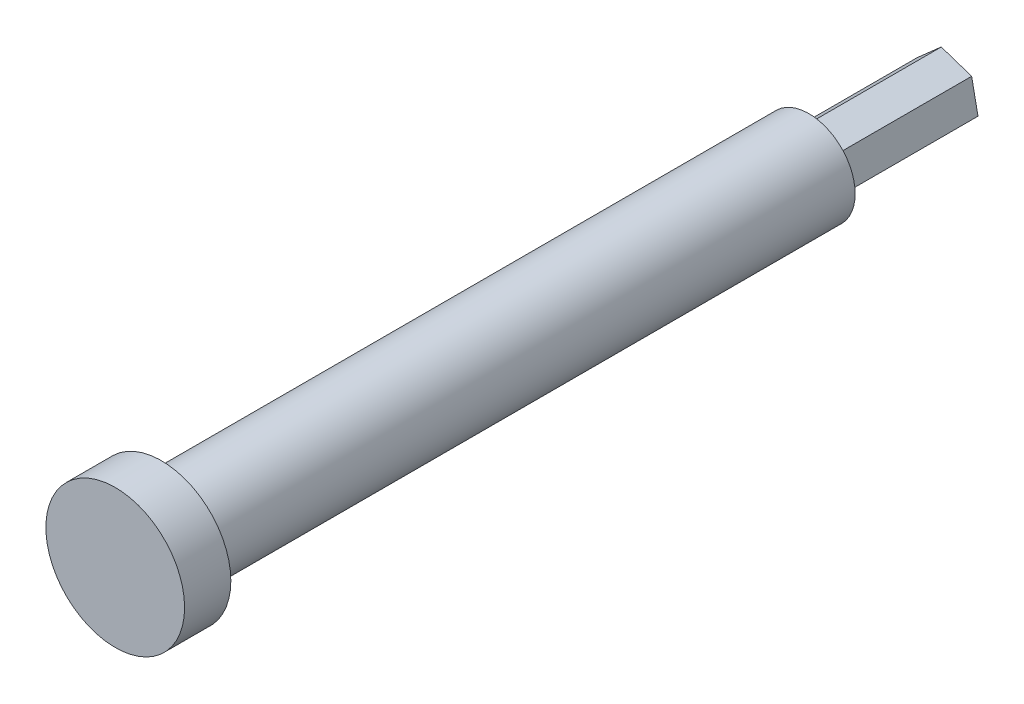
ISO-10303-21;
HEADER;
FILE_DESCRIPTION(('STEP AP214'),'2;1');
FILE_NAME('part.step','',(''),(''),'','','');
FILE_SCHEMA(('AUTOMOTIVE_DESIGN { 1 0 10303 214 1 1 1 1 }'));
ENDSEC;
DATA;
#1=APPLICATION_CONTEXT('core data for automotive mechanical design processes');
#2=APPLICATION_PROTOCOL_DEFINITION('international standard','automotive_design',2000,#1);
#3=PRODUCT_CONTEXT('',#1,'mechanical');
#4=PRODUCT('Part','Part','',(#3));
#5=PRODUCT_RELATED_PRODUCT_CATEGORY('part','',(#4));
#6=PRODUCT_DEFINITION_FORMATION('','',#4);
#7=PRODUCT_DEFINITION_CONTEXT('part definition',#1,'design');
#8=PRODUCT_DEFINITION('design','',#6,#7);
#9=PRODUCT_DEFINITION_SHAPE('','',#8);
#10=(LENGTH_UNIT() NAMED_UNIT(*) SI_UNIT(.MILLI.,.METRE.));
#11=(NAMED_UNIT(*) PLANE_ANGLE_UNIT() SI_UNIT($,.RADIAN.));
#12=(NAMED_UNIT(*) SI_UNIT($,.STERADIAN.) SOLID_ANGLE_UNIT());
#13=UNCERTAINTY_MEASURE_WITH_UNIT(LENGTH_MEASURE(1.E-05),#10,'distance_accuracy_value','');
#14=(GEOMETRIC_REPRESENTATION_CONTEXT(3) GLOBAL_UNCERTAINTY_ASSIGNED_CONTEXT((#13)) GLOBAL_UNIT_ASSIGNED_CONTEXT((#10,
#11,#12)) REPRESENTATION_CONTEXT('',''));
#15=CARTESIAN_POINT('',(0.,0.,0.));
#16=DIRECTION('',(0.,0.,1.));
#17=DIRECTION('',(1.,0.,0.));
#18=AXIS2_PLACEMENT_3D('',#15,#16,#17);
#19=CARTESIAN_POINT('',(2.59714864054017,2.29233918496812,15.));
#20=DIRECTION('',(-0.318416498756227,-0.947950912927366,0.));
#21=DIRECTION('',(0.947950912927366,-0.318416498756227,0.));
#22=AXIS2_PLACEMENT_3D('',#19,#20,#21);
#23=PLANE('',#22);
#24=DIRECTION('',(-0.947950912927366,0.318416498756227,0.));
#25=VECTOR('',#24,1.);
#26=CARTESIAN_POINT('',(2.59714864054017,2.29233918496812,0.));
#27=LINE('',#26,#25);
#28=CARTESIAN_POINT('',(2.59714864054017,2.29233918496812,0.));
#29=VERTEX_POINT('',#28);
#30=CARTESIAN_POINT('',(-0.686649648002819,3.39536629259607,0.));
#31=VERTEX_POINT('',#30);
#32=EDGE_CURVE('E124',#29,#31,#27,.T.);
#33=ORIENTED_EDGE('',*,*,#32,.T.);
#34=DIRECTION('',(0.,0.,-1.));
#35=VECTOR('',#34,1.);
#36=CARTESIAN_POINT('',(-0.686649648002819,3.39536629259607,15.));
#37=LINE('',#36,#35);
#38=CARTESIAN_POINT('',(-0.686649648002819,3.39536629259607,15.));
#39=VERTEX_POINT('',#38);
#40=EDGE_CURVE('E11',#39,#31,#37,.T.);
#41=ORIENTED_EDGE('',*,*,#40,.F.);
#42=DIRECTION('',(-0.947950912927366,0.318416498756227,0.));
#43=VECTOR('',#42,1.);
#44=CARTESIAN_POINT('',(2.59714864054017,2.29233918496812,15.));
#45=LINE('',#44,#43);
#46=CARTESIAN_POINT('',(2.59714864054017,2.29233918496812,15.));
#47=VERTEX_POINT('',#46);
#48=EDGE_CURVE('E116',#47,#39,#45,.T.);
#49=ORIENTED_EDGE('',*,*,#48,.F.);
#50=DIRECTION('',(0.,0.,-1.));
#51=VECTOR('',#50,1.);
#52=CARTESIAN_POINT('',(2.59714864054017,2.29233918496812,15.));
#53=LINE('',#52,#51);
#54=EDGE_CURVE('E123',#47,#29,#53,.T.);
#55=ORIENTED_EDGE('',*,*,#54,.T.);
#56=EDGE_LOOP('',(#33,#41,#49,#55));
#57=FACE_BOUND('',#56,.T.);
#58=ADVANCED_FACE('F33',(#57),#23,.F.);
#59=CARTESIAN_POINT('',(-0.686649648002819,3.39536629259607,15.));
#60=DIRECTION('',(0.661741322757637,-0.74973223337067,0.));
#61=DIRECTION('',(0.74973223337067,0.661741322757637,0.));
#62=AXIS2_PLACEMENT_3D('',#59,#60,#61);
#63=PLANE('',#62);
#64=DIRECTION('',(-0.74973223337067,-0.661741322757637,0.));
#65=VECTOR('',#64,1.);
#66=CARTESIAN_POINT('',(-0.686649648002819,3.39536629259607,0.));
#67=LINE('',#66,#65);
#68=CARTESIAN_POINT('',(-3.28379828854299,1.10302710762795,0.));
#69=VERTEX_POINT('',#68);
#70=EDGE_CURVE('E127',#31,#69,#67,.T.);
#71=ORIENTED_EDGE('',*,*,#70,.T.);
#72=DIRECTION('',(0.,0.,-1.));
#73=VECTOR('',#72,1.);
#74=CARTESIAN_POINT('',(-3.28379828854299,1.10302710762795,15.));
#75=LINE('',#74,#73);
#76=CARTESIAN_POINT('',(-3.28379828854299,1.10302710762795,15.));
#77=VERTEX_POINT('',#76);
#78=EDGE_CURVE('E41',#77,#69,#75,.T.);
#79=ORIENTED_EDGE('',*,*,#78,.F.);
#80=DIRECTION('',(-0.74973223337067,-0.661741322757637,0.));
#81=VECTOR('',#80,1.);
#82=CARTESIAN_POINT('',(-0.686649648002819,3.39536629259607,15.));
#83=LINE('',#82,#81);
#84=EDGE_CURVE('E85',#39,#77,#83,.T.);
#85=ORIENTED_EDGE('',*,*,#84,.F.);
#86=ORIENTED_EDGE('',*,*,#40,.T.);
#87=EDGE_LOOP('',(#71,#79,#85,#86));
#88=FACE_BOUND('',#87,.T.);
#89=ADVANCED_FACE('F184',(#88),#63,.F.);
#90=CARTESIAN_POINT('',(-3.28379828854299,1.10302710762795,15.));
#91=DIRECTION('',(0.980157821513862,0.198218679556695,0.));
#92=DIRECTION('',(-0.198218679556695,0.980157821513862,0.));
#93=AXIS2_PLACEMENT_3D('',#90,#91,#92);
#94=PLANE('',#93);
#95=DIRECTION('',(0.198218679556695,-0.980157821513862,0.));
#96=VECTOR('',#95,1.);
#97=CARTESIAN_POINT('',(-3.28379828854299,1.10302710762795,0.));
#98=LINE('',#97,#96);
#99=CARTESIAN_POINT('',(-2.59714864054017,-2.29233918496812,0.));
#100=VERTEX_POINT('',#99);
#101=EDGE_CURVE('E100',#69,#100,#98,.T.);
#102=ORIENTED_EDGE('',*,*,#101,.T.);
#103=DIRECTION('',(0.,0.,-1.));
#104=VECTOR('',#103,1.);
#105=CARTESIAN_POINT('',(-2.59714864054017,-2.29233918496812,15.));
#106=LINE('',#105,#104);
#107=CARTESIAN_POINT('',(-2.59714864054017,-2.29233918496812,15.));
#108=VERTEX_POINT('',#107);
#109=EDGE_CURVE('E93',#108,#100,#106,.T.);
#110=ORIENTED_EDGE('',*,*,#109,.F.);
#111=DIRECTION('',(0.198218679556695,-0.980157821513862,0.));
#112=VECTOR('',#111,1.);
#113=CARTESIAN_POINT('',(-3.28379828854299,1.10302710762795,15.));
#114=LINE('',#113,#112);
#115=EDGE_CURVE('E98',#77,#108,#114,.T.);
#116=ORIENTED_EDGE('',*,*,#115,.F.);
#117=ORIENTED_EDGE('',*,*,#78,.T.);
#118=EDGE_LOOP('',(#102,#110,#116,#117));
#119=FACE_BOUND('',#118,.T.);
#120=ADVANCED_FACE('F95',(#119),#94,.F.);
#121=CARTESIAN_POINT('',(-2.59714864054017,-2.29233918496812,15.));
#122=DIRECTION('',(0.318416498756226,0.947950912927366,0.));
#123=DIRECTION('',(-0.947950912927366,0.318416498756226,0.));
#124=AXIS2_PLACEMENT_3D('',#121,#122,#123);
#125=PLANE('',#124);
#126=DIRECTION('',(0.947950912927366,-0.318416498756226,0.));
#127=VECTOR('',#126,1.);
#128=CARTESIAN_POINT('',(-2.59714864054017,-2.29233918496812,0.));
#129=LINE('',#128,#127);
#130=CARTESIAN_POINT('',(0.686649648002809,-3.39536629259606,0.));
#131=VERTEX_POINT('',#130);
#132=EDGE_CURVE('E131',#100,#131,#129,.T.);
#133=ORIENTED_EDGE('',*,*,#132,.T.);
#134=DIRECTION('',(0.,0.,-1.));
#135=VECTOR('',#134,1.);
#136=CARTESIAN_POINT('',(0.686649648002809,-3.39536629259606,15.));
#137=LINE('',#136,#135);
#138=CARTESIAN_POINT('',(0.686649648002809,-3.39536629259606,15.));
#139=VERTEX_POINT('',#138);
#140=EDGE_CURVE('E103',#139,#131,#137,.T.);
#141=ORIENTED_EDGE('',*,*,#140,.F.);
#142=DIRECTION('',(0.947950912927366,-0.318416498756226,0.));
#143=VECTOR('',#142,1.);
#144=CARTESIAN_POINT('',(-2.59714864054017,-2.29233918496812,15.));
#145=LINE('',#144,#143);
#146=EDGE_CURVE('E106',#108,#139,#145,.T.);
#147=ORIENTED_EDGE('',*,*,#146,.F.);
#148=ORIENTED_EDGE('',*,*,#109,.T.);
#149=EDGE_LOOP('',(#133,#141,#147,#148));
#150=FACE_BOUND('',#149,.T.);
#151=ADVANCED_FACE('F107',(#150),#125,.F.);
#152=CARTESIAN_POINT('',(0.686649648002809,-3.39536629259606,15.));
#153=DIRECTION('',(-0.661741322757635,0.749732233370671,0.));
#154=DIRECTION('',(-0.749732233370672,-0.661741322757635,0.));
#155=AXIS2_PLACEMENT_3D('',#152,#153,#154);
#156=PLANE('',#155);
#157=DIRECTION('',(0.749732233370671,0.661741322757635,0.));
#158=VECTOR('',#157,1.);
#159=CARTESIAN_POINT('',(0.686649648002809,-3.39536629259606,0.));
#160=LINE('',#159,#158);
#161=CARTESIAN_POINT('',(3.28379828854299,-1.10302710762795,0.));
#162=VERTEX_POINT('',#161);
#163=EDGE_CURVE('E71',#131,#162,#160,.T.);
#164=ORIENTED_EDGE('',*,*,#163,.T.);
#165=DIRECTION('',(0.,0.,-1.));
#166=VECTOR('',#165,1.);
#167=CARTESIAN_POINT('',(3.28379828854299,-1.10302710762795,15.));
#168=LINE('',#167,#166);
#169=CARTESIAN_POINT('',(3.28379828854299,-1.10302710762795,15.));
#170=VERTEX_POINT('',#169);
#171=EDGE_CURVE('E49',#170,#162,#168,.T.);
#172=ORIENTED_EDGE('',*,*,#171,.F.);
#173=DIRECTION('',(0.749732233370671,0.661741322757635,0.));
#174=VECTOR('',#173,1.);
#175=CARTESIAN_POINT('',(0.686649648002809,-3.39536629259606,15.));
#176=LINE('',#175,#174);
#177=EDGE_CURVE('E110',#139,#170,#176,.T.);
#178=ORIENTED_EDGE('',*,*,#177,.F.);
#179=ORIENTED_EDGE('',*,*,#140,.T.);
#180=EDGE_LOOP('',(#164,#172,#178,#179));
#181=FACE_BOUND('',#180,.T.);
#182=ADVANCED_FACE('F140',(#181),#156,.F.);
#183=CARTESIAN_POINT('',(3.28379828854299,-1.10302710762795,15.));
#184=DIRECTION('',(-0.980157821513862,-0.198218679556695,0.));
#185=DIRECTION('',(0.198218679556695,-0.980157821513862,0.));
#186=AXIS2_PLACEMENT_3D('',#183,#184,#185);
#187=PLANE('',#186);
#188=DIRECTION('',(-0.198218679556695,0.980157821513862,0.));
#189=VECTOR('',#188,1.);
#190=CARTESIAN_POINT('',(3.28379828854299,-1.10302710762795,0.));
#191=LINE('',#190,#189);
#192=EDGE_CURVE('E77',#162,#29,#191,.T.);
#193=ORIENTED_EDGE('',*,*,#192,.T.);
#194=ORIENTED_EDGE('',*,*,#54,.F.);
#195=DIRECTION('',(-0.198218679556695,0.980157821513862,0.));
#196=VECTOR('',#195,1.);
#197=CARTESIAN_POINT('',(3.28379828854299,-1.10302710762795,15.));
#198=LINE('',#197,#196);
#199=EDGE_CURVE('E121',#170,#47,#198,.T.);
#200=ORIENTED_EDGE('',*,*,#199,.F.);
#201=ORIENTED_EDGE('',*,*,#171,.T.);
#202=EDGE_LOOP('',(#193,#194,#200,#201));
#203=FACE_BOUND('',#202,.T.);
#204=ADVANCED_FACE('F142',(#203),#187,.F.);
#205=CARTESIAN_POINT('',(0.,0.,0.));
#206=DIRECTION('',(0.,0.,1.));
#207=DIRECTION('',(1.,0.,0.));
#208=AXIS2_PLACEMENT_3D('',#205,#206,#207);
#209=PLANE('',#208);
#210=ORIENTED_EDGE('',*,*,#32,.F.);
#211=ORIENTED_EDGE('',*,*,#192,.F.);
#212=ORIENTED_EDGE('',*,*,#163,.F.);
#213=ORIENTED_EDGE('',*,*,#132,.F.);
#214=ORIENTED_EDGE('',*,*,#101,.F.);
#215=ORIENTED_EDGE('',*,*,#70,.F.);
#216=EDGE_LOOP('',(#210,#211,#212,#213,#214,#215));
#217=FACE_BOUND('',#216,.T.);
#218=ADVANCED_FACE('F139',(#217),#209,.F.);
#219=CARTESIAN_POINT('',(0.,0.,15.));
#220=DIRECTION('',(0.,0.,1.));
#221=DIRECTION('',(1.,0.,0.));
#222=AXIS2_PLACEMENT_3D('',#219,#220,#221);
#223=PLANE('',#222);
#224=CARTESIAN_POINT('',(0.,0.,15.));
#225=DIRECTION('',(0.,0.,1.));
#226=DIRECTION('',(1.,0.,0.));
#227=AXIS2_PLACEMENT_3D('',#224,#225,#226);
#228=CIRCLE('',#227,5.);
#229=CARTESIAN_POINT('',(5.,0.,15.));
#230=VERTEX_POINT('',#229);
#231=EDGE_CURVE('E145',#230,#230,#228,.T.);
#232=ORIENTED_EDGE('',*,*,#231,.F.);
#233=EDGE_LOOP('',(#232));
#234=FACE_BOUND('',#233,.T.);
#235=ORIENTED_EDGE('',*,*,#199,.T.);
#236=ORIENTED_EDGE('',*,*,#48,.T.);
#237=ORIENTED_EDGE('',*,*,#84,.T.);
#238=ORIENTED_EDGE('',*,*,#115,.T.);
#239=ORIENTED_EDGE('',*,*,#146,.T.);
#240=ORIENTED_EDGE('',*,*,#177,.T.);
#241=EDGE_LOOP('',(#235,#236,#237,#238,#239,#240));
#242=FACE_BOUND('',#241,.T.);
#243=ADVANCED_FACE('F113',(#234,#242),#223,.F.);
#244=CARTESIAN_POINT('',(0.,0.,85.));
#245=DIRECTION('',(0.,0.,-1.));
#246=DIRECTION('',(-1.,0.,0.));
#247=AXIS2_PLACEMENT_3D('',#244,#245,#246);
#248=CYLINDRICAL_SURFACE('',#247,5.);
#249=CARTESIAN_POINT('',(0.,0.,85.));
#250=DIRECTION('',(0.,0.,1.));
#251=DIRECTION('',(1.,0.,0.));
#252=AXIS2_PLACEMENT_3D('',#249,#250,#251);
#253=CIRCLE('',#252,5.);
#254=CARTESIAN_POINT('',(5.,0.,85.));
#255=VERTEX_POINT('',#254);
#256=EDGE_CURVE('E128',#255,#255,#253,.T.);
#257=ORIENTED_EDGE('',*,*,#256,.F.);
#258=EDGE_LOOP('',(#257));
#259=FACE_BOUND('',#258,.T.);
#260=ORIENTED_EDGE('',*,*,#231,.T.);
#261=EDGE_LOOP('',(#260));
#262=FACE_BOUND('',#261,.T.);
#263=ADVANCED_FACE('F168',(#259,#262),#248,.T.);
#264=CARTESIAN_POINT('',(0.,0.,85.));
#265=DIRECTION('',(0.,0.,1.));
#266=DIRECTION('',(1.,0.,0.));
#267=AXIS2_PLACEMENT_3D('',#264,#265,#266);
#268=PLANE('',#267);
#269=CARTESIAN_POINT('',(0.,0.,85.));
#270=DIRECTION('',(0.,0.,1.));
#271=DIRECTION('',(1.,0.,0.));
#272=AXIS2_PLACEMENT_3D('',#269,#270,#271);
#273=CIRCLE('',#272,7.5);
#274=CARTESIAN_POINT('',(7.5,0.,85.));
#275=VERTEX_POINT('',#274);
#276=EDGE_CURVE('E151',#275,#275,#273,.T.);
#277=ORIENTED_EDGE('',*,*,#276,.F.);
#278=EDGE_LOOP('',(#277));
#279=FACE_BOUND('',#278,.T.);
#280=ORIENTED_EDGE('',*,*,#256,.T.);
#281=EDGE_LOOP('',(#280));
#282=FACE_BOUND('',#281,.T.);
#283=ADVANCED_FACE('F162',(#279,#282),#268,.F.);
#284=CARTESIAN_POINT('',(0.,0.,90.));
#285=DIRECTION('',(0.,0.,-1.));
#286=DIRECTION('',(-1.,0.,0.));
#287=AXIS2_PLACEMENT_3D('',#284,#285,#286);
#288=CYLINDRICAL_SURFACE('',#287,7.5);
#289=CARTESIAN_POINT('',(0.,0.,90.));
#290=DIRECTION('',(0.,0.,1.));
#291=DIRECTION('',(1.,0.,0.));
#292=AXIS2_PLACEMENT_3D('',#289,#290,#291);
#293=CIRCLE('',#292,7.5);
#294=CARTESIAN_POINT('',(7.5,0.,90.));
#295=VERTEX_POINT('',#294);
#296=EDGE_CURVE('E148',#295,#295,#293,.T.);
#297=ORIENTED_EDGE('',*,*,#296,.F.);
#298=EDGE_LOOP('',(#297));
#299=FACE_BOUND('',#298,.T.);
#300=ORIENTED_EDGE('',*,*,#276,.T.);
#301=EDGE_LOOP('',(#300));
#302=FACE_BOUND('',#301,.T.);
#303=ADVANCED_FACE('F159',(#299,#302),#288,.T.);
#304=CARTESIAN_POINT('',(0.,0.,90.));
#305=DIRECTION('',(0.,0.,1.));
#306=DIRECTION('',(1.,0.,0.));
#307=AXIS2_PLACEMENT_3D('',#304,#305,#306);
#308=PLANE('',#307);
#309=ORIENTED_EDGE('',*,*,#296,.T.);
#310=EDGE_LOOP('',(#309));
#311=FACE_BOUND('',#310,.T.);
#312=ADVANCED_FACE('F157',(#311),#308,.T.);
#313=CLOSED_SHELL('',(#58,#89,#120,#151,#182,#204,#218,#243,#263,#283,#303,#312));
#314=MANIFOLD_SOLID_BREP('B2',#313);
#315=ADVANCED_BREP_SHAPE_REPRESENTATION('',(#18,#314),#14);
#316=SHAPE_DEFINITION_REPRESENTATION(#9,#315);
ENDSEC;
END-ISO-10303-21;
